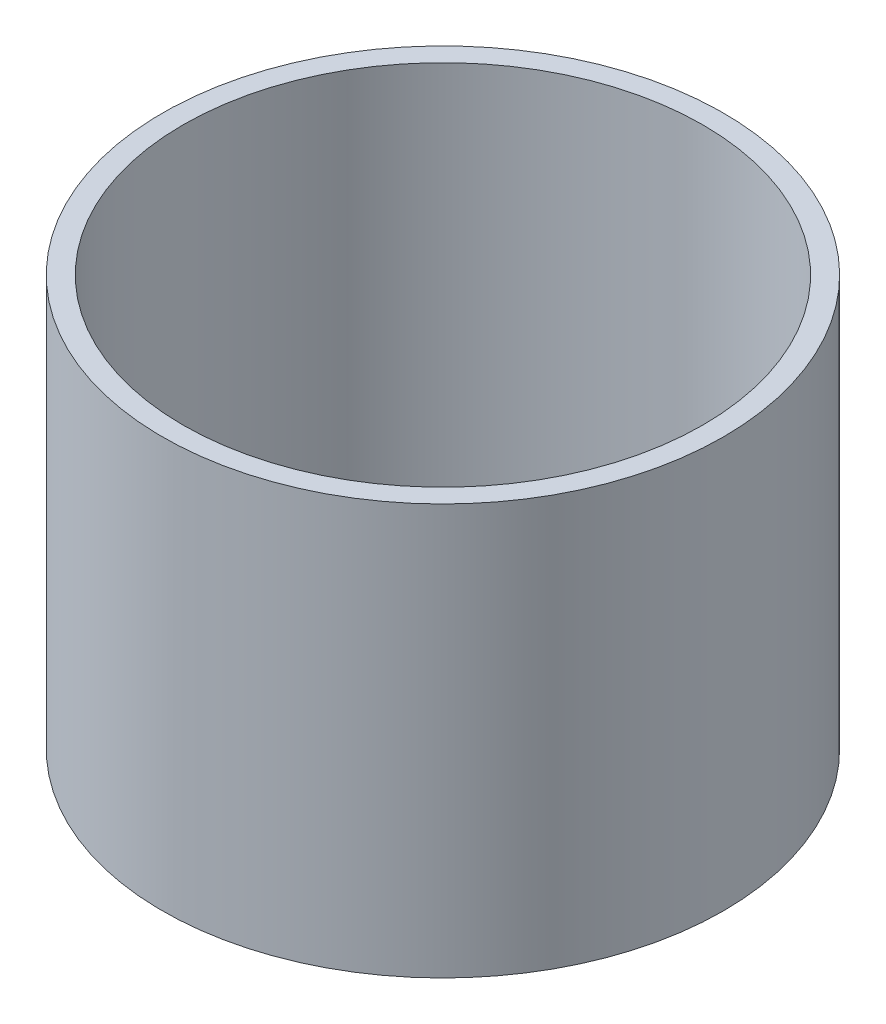
ISO-10303-21;
HEADER;
FILE_DESCRIPTION(('STEP AP214'),'2;1');
FILE_NAME('part.step','',(''),(''),'','','');
FILE_SCHEMA(('AUTOMOTIVE_DESIGN { 1 0 10303 214 1 1 1 1 }'));
ENDSEC;
DATA;
#1=APPLICATION_CONTEXT('core data for automotive mechanical design processes');
#2=APPLICATION_PROTOCOL_DEFINITION('international standard','automotive_design',2000,#1);
#3=PRODUCT_CONTEXT('',#1,'mechanical');
#4=PRODUCT('Part','Part','',(#3));
#5=PRODUCT_RELATED_PRODUCT_CATEGORY('part','',(#4));
#6=PRODUCT_DEFINITION_FORMATION('','',#4);
#7=PRODUCT_DEFINITION_CONTEXT('part definition',#1,'design');
#8=PRODUCT_DEFINITION('design','',#6,#7);
#9=PRODUCT_DEFINITION_SHAPE('','',#8);
#10=(LENGTH_UNIT() NAMED_UNIT(*) SI_UNIT(.MILLI.,.METRE.));
#11=(NAMED_UNIT(*) PLANE_ANGLE_UNIT() SI_UNIT($,.RADIAN.));
#12=(NAMED_UNIT(*) SI_UNIT($,.STERADIAN.) SOLID_ANGLE_UNIT());
#13=UNCERTAINTY_MEASURE_WITH_UNIT(LENGTH_MEASURE(1.E-05),#10,'distance_accuracy_value','');
#14=(GEOMETRIC_REPRESENTATION_CONTEXT(3) GLOBAL_UNCERTAINTY_ASSIGNED_CONTEXT((#13)) GLOBAL_UNIT_ASSIGNED_CONTEXT((#10,
#11,#12)) REPRESENTATION_CONTEXT('',''));
#15=CARTESIAN_POINT('',(0.,0.,0.));
#16=DIRECTION('',(0.,0.,1.));
#17=DIRECTION('',(1.,0.,0.));
#18=AXIS2_PLACEMENT_3D('',#15,#16,#17);
#19=CARTESIAN_POINT('',(19.,30.,0.));
#20=DIRECTION('',(0.,1.,0.));
#21=DIRECTION('',(-1.,0.,0.));
#22=AXIS2_PLACEMENT_3D('',#19,#20,#21);
#23=PLANE('',#22);
#24=CARTESIAN_POINT('',(-1.04744440165293E-13,30.,0.));
#25=DIRECTION('',(0.,-1.,0.));
#26=DIRECTION('',(1.,0.,0.));
#27=AXIS2_PLACEMENT_3D('',#24,#25,#26);
#28=CIRCLE('',#27,19.0000000000001);
#29=CARTESIAN_POINT('',(19.,30.0000000000001,0.));
#30=VERTEX_POINT('',#29);
#31=EDGE_CURVE('E53',#30,#30,#28,.T.);
#32=ORIENTED_EDGE('',*,*,#31,.T.);
#33=EDGE_LOOP('',(#32));
#34=FACE_BOUND('',#33,.T.);
#35=CARTESIAN_POINT('',(-1.04744440165293E-13,30.,0.));
#36=DIRECTION('',(0.,-1.,0.));
#37=DIRECTION('',(1.,0.,0.));
#38=AXIS2_PLACEMENT_3D('',#35,#36,#37);
#39=CIRCLE('',#38,20.5000000000001);
#40=CARTESIAN_POINT('',(20.5,30.0000000000001,0.));
#41=VERTEX_POINT('',#40);
#42=EDGE_CURVE('E10',#41,#41,#39,.T.);
#43=ORIENTED_EDGE('',*,*,#42,.F.);
#44=EDGE_LOOP('',(#43));
#45=FACE_BOUND('',#44,.T.);
#46=ADVANCED_FACE('F31',(#34,#45),#23,.T.);
#47=CARTESIAN_POINT('',(3.49148133884313E-12,-1000.,0.));
#48=DIRECTION('',(0.,-1.,0.));
#49=DIRECTION('',(1.,0.,0.));
#50=AXIS2_PLACEMENT_3D('',#47,#48,#49);
#51=CYLINDRICAL_SURFACE('',#50,20.5000000000001);
#52=ORIENTED_EDGE('',*,*,#42,.T.);
#53=EDGE_LOOP('',(#52));
#54=FACE_BOUND('',#53,.T.);
#55=CARTESIAN_POINT('',(0.,-1.11022302462516E-13,0.));
#56=DIRECTION('',(0.,-1.,0.));
#57=DIRECTION('',(1.,0.,0.));
#58=AXIS2_PLACEMENT_3D('',#55,#56,#57);
#59=CIRCLE('',#58,20.5);
#60=CARTESIAN_POINT('',(20.5,0.,0.));
#61=VERTEX_POINT('',#60);
#62=EDGE_CURVE('E37',#61,#61,#59,.T.);
#63=ORIENTED_EDGE('',*,*,#62,.F.);
#64=EDGE_LOOP('',(#63));
#65=FACE_BOUND('',#64,.T.);
#66=ADVANCED_FACE('F71',(#54,#65),#51,.T.);
#67=CARTESIAN_POINT('',(0.,-5.27756839685989,0.));
#68=DIRECTION('',(0.,1.,0.));
#69=DIRECTION('',(-1.,0.,0.));
#70=AXIS2_PLACEMENT_3D('',#67,#68,#69);
#71=CONICAL_SURFACE('',#70,5.99999999999998,1.22173047639604);
#72=ORIENTED_EDGE('',*,*,#62,.T.);
#73=EDGE_LOOP('',(#72));
#74=FACE_BOUND('',#73,.T.);
#75=CARTESIAN_POINT('',(0.,-5.27756839685989,0.));
#76=DIRECTION('',(0.,-1.,0.));
#77=DIRECTION('',(1.,0.,0.));
#78=AXIS2_PLACEMENT_3D('',#75,#76,#77);
#79=CIRCLE('',#78,5.99999999999998);
#80=CARTESIAN_POINT('',(6.,-5.27756839685987,0.));
#81=VERTEX_POINT('',#80);
#82=EDGE_CURVE('E41',#81,#81,#79,.T.);
#83=ORIENTED_EDGE('',*,*,#82,.F.);
#84=EDGE_LOOP('',(#83));
#85=FACE_BOUND('',#84,.T.);
#86=ADVANCED_FACE('F75',(#74,#85),#71,.T.);
#87=CARTESIAN_POINT('',(6.,-5.27756839685983,0.));
#88=DIRECTION('',(0.,-1.,0.));
#89=DIRECTION('',(1.,0.,0.));
#90=AXIS2_PLACEMENT_3D('',#87,#88,#89);
#91=PLANE('',#90);
#92=ORIENTED_EDGE('',*,*,#82,.T.);
#93=EDGE_LOOP('',(#92));
#94=FACE_BOUND('',#93,.T.);
#95=CARTESIAN_POINT('',(0.,-5.27756839685989,0.));
#96=DIRECTION('',(0.,-1.,0.));
#97=DIRECTION('',(1.,0.,0.));
#98=AXIS2_PLACEMENT_3D('',#95,#96,#97);
#99=CIRCLE('',#98,4.49999999999998);
#100=CARTESIAN_POINT('',(4.5,-5.27756839685987,0.));
#101=VERTEX_POINT('',#100);
#102=EDGE_CURVE('E45',#101,#101,#99,.T.);
#103=ORIENTED_EDGE('',*,*,#102,.F.);
#104=EDGE_LOOP('',(#103));
#105=FACE_BOUND('',#104,.T.);
#106=ADVANCED_FACE('F67',(#94,#105),#91,.T.);
#107=CARTESIAN_POINT('',(0.,-1.11022302462516E-13,0.));
#108=DIRECTION('',(0.,1.,0.));
#109=DIRECTION('',(-1.,0.,0.));
#110=AXIS2_PLACEMENT_3D('',#107,#108,#109);
#111=CONICAL_SURFACE('',#110,19.,1.22173047639604);
#112=ORIENTED_EDGE('',*,*,#102,.T.);
#113=EDGE_LOOP('',(#112));
#114=FACE_BOUND('',#113,.T.);
#115=CARTESIAN_POINT('',(0.,-1.11022302462516E-13,0.));
#116=DIRECTION('',(0.,-1.,0.));
#117=DIRECTION('',(1.,0.,0.));
#118=AXIS2_PLACEMENT_3D('',#115,#116,#117);
#119=CIRCLE('',#118,19.);
#120=CARTESIAN_POINT('',(19.,0.,0.));
#121=VERTEX_POINT('',#120);
#122=EDGE_CURVE('E50',#121,#121,#119,.T.);
#123=ORIENTED_EDGE('',*,*,#122,.F.);
#124=EDGE_LOOP('',(#123));
#125=FACE_BOUND('',#124,.T.);
#126=ADVANCED_FACE('F61',(#114,#125),#111,.F.);
#127=CARTESIAN_POINT('',(3.49148133884313E-12,-1000.,0.));
#128=DIRECTION('',(0.,-1.,0.));
#129=DIRECTION('',(1.,0.,0.));
#130=AXIS2_PLACEMENT_3D('',#127,#128,#129);
#131=CYLINDRICAL_SURFACE('',#130,19.0000000000001);
#132=ORIENTED_EDGE('',*,*,#122,.T.);
#133=EDGE_LOOP('',(#132));
#134=FACE_BOUND('',#133,.T.);
#135=ORIENTED_EDGE('',*,*,#31,.F.);
#136=EDGE_LOOP('',(#135));
#137=FACE_BOUND('',#136,.T.);
#138=ADVANCED_FACE('F59',(#134,#137),#131,.F.);
#139=CLOSED_SHELL('',(#46,#66,#86,#106,#126,#138));
#140=MANIFOLD_SOLID_BREP('B2',#139);
#141=ADVANCED_BREP_SHAPE_REPRESENTATION('',(#18,#140),#14);
#142=SHAPE_DEFINITION_REPRESENTATION(#9,#141);
ENDSEC;
END-ISO-10303-21;
